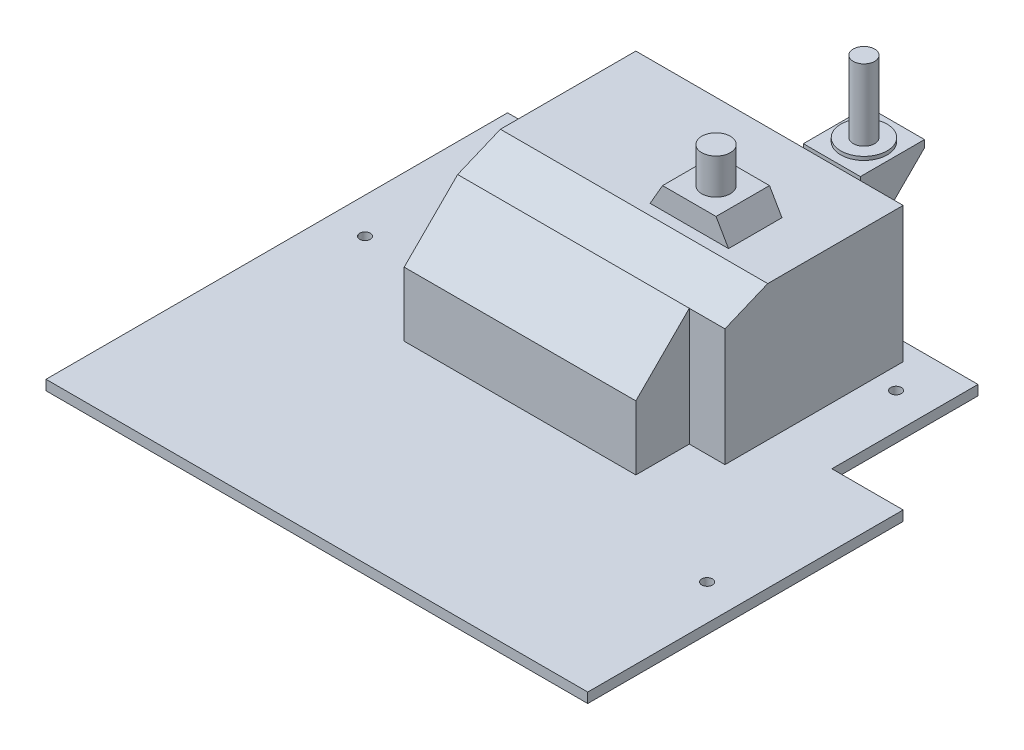
ISO-10303-21;
HEADER;
FILE_DESCRIPTION(('STEP AP214'),'2;1');
FILE_NAME('part.step','',(''),(''),'','','');
FILE_SCHEMA(('AUTOMOTIVE_DESIGN { 1 0 10303 214 1 1 1 1 }'));
ENDSEC;
DATA;
#1=APPLICATION_CONTEXT('core data for automotive mechanical design processes');
#2=APPLICATION_PROTOCOL_DEFINITION('international standard','automotive_design',2000,#1);
#3=PRODUCT_CONTEXT('',#1,'mechanical');
#4=PRODUCT('Part','Part','',(#3));
#5=PRODUCT_RELATED_PRODUCT_CATEGORY('part','',(#4));
#6=PRODUCT_DEFINITION_FORMATION('','',#4);
#7=PRODUCT_DEFINITION_CONTEXT('part definition',#1,'design');
#8=PRODUCT_DEFINITION('design','',#6,#7);
#9=PRODUCT_DEFINITION_SHAPE('','',#8);
#10=(LENGTH_UNIT() NAMED_UNIT(*) SI_UNIT(.MILLI.,.METRE.));
#11=(NAMED_UNIT(*) PLANE_ANGLE_UNIT() SI_UNIT($,.RADIAN.));
#12=(NAMED_UNIT(*) SI_UNIT($,.STERADIAN.) SOLID_ANGLE_UNIT());
#13=UNCERTAINTY_MEASURE_WITH_UNIT(LENGTH_MEASURE(1.E-05),#10,'distance_accuracy_value','');
#14=(GEOMETRIC_REPRESENTATION_CONTEXT(3) GLOBAL_UNCERTAINTY_ASSIGNED_CONTEXT((#13)) GLOBAL_UNIT_ASSIGNED_CONTEXT((#10,
#11,#12)) REPRESENTATION_CONTEXT('',''));
#15=CARTESIAN_POINT('',(0.,0.,0.));
#16=DIRECTION('',(0.,0.,1.));
#17=DIRECTION('',(1.,0.,0.));
#18=AXIS2_PLACEMENT_3D('',#15,#16,#17);
#19=CARTESIAN_POINT('',(0.,40.8,-59.75));
#20=DIRECTION('',(0.,0.,-1.));
#21=DIRECTION('',(-1.,0.,0.));
#22=AXIS2_PLACEMENT_3D('',#19,#20,#21);
#23=PLANE('',#22);
#24=DIRECTION('',(-1.,0.,0.));
#25=VECTOR('',#24,1.);
#26=CARTESIAN_POINT('',(28.,21.8,-59.75));
#27=LINE('',#26,#25);
#28=CARTESIAN_POINT('',(28.,21.8,-59.75));
#29=VERTEX_POINT('',#28);
#30=CARTESIAN_POINT('',(12.,21.8,-59.75));
#31=VERTEX_POINT('',#30);
#32=EDGE_CURVE('E257',#29,#31,#27,.T.);
#33=ORIENTED_EDGE('',*,*,#32,.F.);
#34=DIRECTION('',(0.,-1.,0.));
#35=VECTOR('',#34,1.);
#36=CARTESIAN_POINT('',(28.,41.8,-59.75));
#37=LINE('',#36,#35);
#38=CARTESIAN_POINT('',(28.,40.8,-59.75));
#39=VERTEX_POINT('',#38);
#40=EDGE_CURVE('E242',#39,#29,#37,.T.);
#41=ORIENTED_EDGE('',*,*,#40,.F.);
#42=DIRECTION('',(1.,0.,0.));
#43=VECTOR('',#42,1.);
#44=CARTESIAN_POINT('',(0.,40.8,-59.75));
#45=LINE('',#44,#43);
#46=CARTESIAN_POINT('',(40.,40.8,-59.75));
#47=VERTEX_POINT('',#46);
#48=EDGE_CURVE('E293',#39,#47,#45,.T.);
#49=ORIENTED_EDGE('',*,*,#48,.T.);
#50=DIRECTION('',(0.,-1.,0.));
#51=VECTOR('',#50,1.);
#52=CARTESIAN_POINT('',(40.,40.8,-59.75));
#53=LINE('',#52,#51);
#54=CARTESIAN_POINT('',(40.,2.8,-59.75));
#55=VERTEX_POINT('',#54);
#56=EDGE_CURVE('E320',#47,#55,#53,.T.);
#57=ORIENTED_EDGE('',*,*,#56,.T.);
#58=DIRECTION('',(1.,0.,0.));
#59=VECTOR('',#58,1.);
#60=CARTESIAN_POINT('',(0.,2.8,-59.75));
#61=LINE('',#60,#59);
#62=CARTESIAN_POINT('',(-35.,2.8,-59.75));
#63=VERTEX_POINT('',#62);
#64=EDGE_CURVE('E313',#63,#55,#61,.T.);
#65=ORIENTED_EDGE('',*,*,#64,.F.);
#66=DIRECTION('',(0.,-1.,0.));
#67=VECTOR('',#66,1.);
#68=CARTESIAN_POINT('',(-35.,40.8,-59.75));
#69=LINE('',#68,#67);
#70=CARTESIAN_POINT('',(-35.,40.8,-59.75));
#71=VERTEX_POINT('',#70);
#72=EDGE_CURVE('E317',#71,#63,#69,.T.);
#73=ORIENTED_EDGE('',*,*,#72,.F.);
#74=CARTESIAN_POINT('',(12.,40.8,-59.75));
#75=VERTEX_POINT('',#74);
#76=EDGE_CURVE('E295',#71,#75,#45,.T.);
#77=ORIENTED_EDGE('',*,*,#76,.T.);
#78=DIRECTION('',(0.,1.,0.));
#79=VECTOR('',#78,1.);
#80=CARTESIAN_POINT('',(12.,41.8,-59.75));
#81=LINE('',#80,#79);
#82=EDGE_CURVE('E260',#31,#75,#81,.T.);
#83=ORIENTED_EDGE('',*,*,#82,.F.);
#84=EDGE_LOOP('',(#33,#41,#49,#57,#65,#73,#77,#83));
#85=FACE_BOUND('',#84,.T.);
#86=ADVANCED_FACE('F36',(#85),#23,.T.);
#87=CARTESIAN_POINT('',(0.,2.8,0.));
#88=DIRECTION('',(0.,1.,0.));
#89=DIRECTION('',(0.,0.,1.));
#90=AXIS2_PLACEMENT_3D('',#87,#88,#89);
#91=PLANE('',#90);
#92=CARTESIAN_POINT('',(66.,2.8,21.25));
#93=DIRECTION('',(0.,1.,0.));
#94=DIRECTION('',(0.,0.,1.));
#95=AXIS2_PLACEMENT_3D('',#92,#93,#94);
#96=CIRCLE('',#95,1.5);
#97=CARTESIAN_POINT('',(66.,2.8,22.75));
#98=VERTEX_POINT('',#97);
#99=EDGE_CURVE('E330',#98,#98,#96,.T.);
#100=ORIENTED_EDGE('',*,*,#99,.F.);
#101=EDGE_LOOP('',(#100));
#102=FACE_BOUND('',#101,.T.);
#103=CARTESIAN_POINT('',(-66.,2.8,-14.75));
#104=DIRECTION('',(0.,1.,0.));
#105=DIRECTION('',(0.,0.,1.));
#106=AXIS2_PLACEMENT_3D('',#103,#104,#105);
#107=CIRCLE('',#106,1.5);
#108=CARTESIAN_POINT('',(-66.,2.8,-13.25));
#109=VERTEX_POINT('',#108);
#110=EDGE_CURVE('E333',#109,#109,#107,.T.);
#111=ORIENTED_EDGE('',*,*,#110,.F.);
#112=EDGE_LOOP('',(#111));
#113=FACE_BOUND('',#112,.T.);
#114=CARTESIAN_POINT('',(-46.,2.8,-51.75));
#115=DIRECTION('',(0.,1.,0.));
#116=DIRECTION('',(0.,0.,1.));
#117=AXIS2_PLACEMENT_3D('',#114,#115,#116);
#118=CIRCLE('',#117,1.5);
#119=CARTESIAN_POINT('',(-46.,2.8,-50.25));
#120=VERTEX_POINT('',#119);
#121=EDGE_CURVE('E337',#120,#120,#118,.T.);
#122=ORIENTED_EDGE('',*,*,#121,.F.);
#123=EDGE_LOOP('',(#122));
#124=FACE_BOUND('',#123,.T.);
#125=CARTESIAN_POINT('',(46.,2.8,-51.75));
#126=DIRECTION('',(0.,1.,0.));
#127=DIRECTION('',(0.,0.,1.));
#128=AXIS2_PLACEMENT_3D('',#125,#126,#127);
#129=CIRCLE('',#128,1.5);
#130=CARTESIAN_POINT('',(46.,2.8,-50.25));
#131=VERTEX_POINT('',#130);
#132=EDGE_CURVE('E340',#131,#131,#129,.T.);
#133=ORIENTED_EDGE('',*,*,#132,.F.);
#134=EDGE_LOOP('',(#133));
#135=FACE_BOUND('',#134,.T.);
#136=DIRECTION('',(1.,0.,0.));
#137=VECTOR('',#136,1.);
#138=CARTESIAN_POINT('',(0.,2.8,-23.75));
#139=LINE('',#138,#137);
#140=CARTESIAN_POINT('',(56.,2.8,-23.75));
#141=VERTEX_POINT('',#140);
#142=CARTESIAN_POINT('',(76.,2.8,-23.75));
#143=VERTEX_POINT('',#142);
#144=EDGE_CURVE('E343',#141,#143,#139,.T.);
#145=ORIENTED_EDGE('',*,*,#144,.F.);
#146=DIRECTION('',(0.,0.,1.));
#147=VECTOR('',#146,1.);
#148=CARTESIAN_POINT('',(56.,2.8,0.));
#149=LINE('',#148,#147);
#150=CARTESIAN_POINT('',(56.,2.8,-64.75));
#151=VERTEX_POINT('',#150);
#152=EDGE_CURVE('E346',#151,#141,#149,.T.);
#153=ORIENTED_EDGE('',*,*,#152,.F.);
#154=DIRECTION('',(1.,0.,0.));
#155=VECTOR('',#154,1.);
#156=CARTESIAN_POINT('',(0.,2.8,-64.75));
#157=LINE('',#156,#155);
#158=CARTESIAN_POINT('',(-76.,2.8,-64.75));
#159=VERTEX_POINT('',#158);
#160=EDGE_CURVE('E349',#159,#151,#157,.T.);
#161=ORIENTED_EDGE('',*,*,#160,.F.);
#162=DIRECTION('',(0.,0.,-1.));
#163=VECTOR('',#162,1.);
#164=CARTESIAN_POINT('',(-76.,2.8,0.));
#165=LINE('',#164,#163);
#166=CARTESIAN_POINT('',(-76.,2.8,64.75));
#167=VERTEX_POINT('',#166);
#168=EDGE_CURVE('E352',#167,#159,#165,.T.);
#169=ORIENTED_EDGE('',*,*,#168,.F.);
#170=DIRECTION('',(1.,0.,0.));
#171=VECTOR('',#170,1.);
#172=CARTESIAN_POINT('',(0.,2.8,64.75));
#173=LINE('',#172,#171);
#174=CARTESIAN_POINT('',(76.,2.8,64.75));
#175=VERTEX_POINT('',#174);
#176=EDGE_CURVE('E355',#167,#175,#173,.T.);
#177=ORIENTED_EDGE('',*,*,#176,.T.);
#178=DIRECTION('',(0.,0.,-1.));
#179=VECTOR('',#178,1.);
#180=CARTESIAN_POINT('',(76.,2.8,0.));
#181=LINE('',#180,#179);
#182=EDGE_CURVE('E358',#175,#143,#181,.T.);
#183=ORIENTED_EDGE('',*,*,#182,.T.);
#184=EDGE_LOOP('',(#145,#153,#161,#169,#177,#183));
#185=FACE_BOUND('',#184,.T.);
#186=DIRECTION('',(0.,0.,-1.));
#187=VECTOR('',#186,1.);
#188=CARTESIAN_POINT('',(30.,2.8,0.));
#189=LINE('',#188,#187);
#190=CARTESIAN_POINT('',(30.,2.8,5.25));
#191=VERTEX_POINT('',#190);
#192=CARTESIAN_POINT('',(30.,2.8,-9.75));
#193=VERTEX_POINT('',#192);
#194=EDGE_CURVE('E304',#191,#193,#189,.T.);
#195=ORIENTED_EDGE('',*,*,#194,.F.);
#196=DIRECTION('',(1.,0.,0.));
#197=VECTOR('',#196,1.);
#198=CARTESIAN_POINT('',(0.,2.8,5.25));
#199=LINE('',#198,#197);
#200=CARTESIAN_POINT('',(-35.,2.8,5.25));
#201=VERTEX_POINT('',#200);
#202=EDGE_CURVE('E286',#201,#191,#199,.T.);
#203=ORIENTED_EDGE('',*,*,#202,.F.);
#204=DIRECTION('',(0.,0.,-1.));
#205=VECTOR('',#204,1.);
#206=CARTESIAN_POINT('',(-35.,2.8,0.));
#207=LINE('',#206,#205);
#208=EDGE_CURVE('E294',#201,#63,#207,.T.);
#209=ORIENTED_EDGE('',*,*,#208,.T.);
#210=ORIENTED_EDGE('',*,*,#64,.T.);
#211=DIRECTION('',(0.,0.,-1.));
#212=VECTOR('',#211,1.);
#213=CARTESIAN_POINT('',(40.,2.8,0.));
#214=LINE('',#213,#212);
#215=CARTESIAN_POINT('',(40.,2.8,-9.75));
#216=VERTEX_POINT('',#215);
#217=EDGE_CURVE('E310',#216,#55,#214,.T.);
#218=ORIENTED_EDGE('',*,*,#217,.F.);
#219=DIRECTION('',(-1.,0.,0.));
#220=VECTOR('',#219,1.);
#221=CARTESIAN_POINT('',(0.,2.8,-9.75));
#222=LINE('',#221,#220);
#223=EDGE_CURVE('E307',#216,#193,#222,.T.);
#224=ORIENTED_EDGE('',*,*,#223,.T.);
#225=EDGE_LOOP('',(#195,#203,#209,#210,#218,#224));
#226=FACE_BOUND('',#225,.T.);
#227=ADVANCED_FACE('F428',(#102,#113,#124,#135,#185,#226),#91,.T.);
#228=CARTESIAN_POINT('',(0.,2.8,-23.75));
#229=DIRECTION('',(0.,0.,-1.));
#230=DIRECTION('',(-1.,0.,0.));
#231=AXIS2_PLACEMENT_3D('',#228,#229,#230);
#232=PLANE('',#231);
#233=DIRECTION('',(1.,0.,0.));
#234=VECTOR('',#233,1.);
#235=CARTESIAN_POINT('',(0.,0.,-23.75));
#236=LINE('',#235,#234);
#237=CARTESIAN_POINT('',(56.,0.,-23.75));
#238=VERTEX_POINT('',#237);
#239=CARTESIAN_POINT('',(76.,0.,-23.75));
#240=VERTEX_POINT('',#239);
#241=EDGE_CURVE('E372',#238,#240,#236,.T.);
#242=ORIENTED_EDGE('',*,*,#241,.F.);
#243=DIRECTION('',(0.,-1.,0.));
#244=VECTOR('',#243,1.);
#245=CARTESIAN_POINT('',(56.,2.8,-23.75));
#246=LINE('',#245,#244);
#247=EDGE_CURVE('E399',#141,#238,#246,.T.);
#248=ORIENTED_EDGE('',*,*,#247,.F.);
#249=ORIENTED_EDGE('',*,*,#144,.T.);
#250=DIRECTION('',(0.,-1.,0.));
#251=VECTOR('',#250,1.);
#252=CARTESIAN_POINT('',(76.,2.8,-23.75));
#253=LINE('',#252,#251);
#254=EDGE_CURVE('E360',#143,#240,#253,.T.);
#255=ORIENTED_EDGE('',*,*,#254,.T.);
#256=EDGE_LOOP('',(#242,#248,#249,#255));
#257=FACE_BOUND('',#256,.T.);
#258=ADVANCED_FACE('F434',(#257),#232,.T.);
#259=CARTESIAN_POINT('',(56.,2.8,0.));
#260=DIRECTION('',(1.,0.,0.));
#261=DIRECTION('',(0.,0.,-1.));
#262=AXIS2_PLACEMENT_3D('',#259,#260,#261);
#263=PLANE('',#262);
#264=DIRECTION('',(0.,0.,1.));
#265=VECTOR('',#264,1.);
#266=CARTESIAN_POINT('',(56.,0.,0.));
#267=LINE('',#266,#265);
#268=CARTESIAN_POINT('',(56.,0.,-64.75));
#269=VERTEX_POINT('',#268);
#270=EDGE_CURVE('E375',#269,#238,#267,.T.);
#271=ORIENTED_EDGE('',*,*,#270,.F.);
#272=DIRECTION('',(0.,-1.,0.));
#273=VECTOR('',#272,1.);
#274=CARTESIAN_POINT('',(56.,2.8,-64.75));
#275=LINE('',#274,#273);
#276=EDGE_CURVE('E397',#151,#269,#275,.T.);
#277=ORIENTED_EDGE('',*,*,#276,.F.);
#278=ORIENTED_EDGE('',*,*,#152,.T.);
#279=ORIENTED_EDGE('',*,*,#247,.T.);
#280=EDGE_LOOP('',(#271,#277,#278,#279));
#281=FACE_BOUND('',#280,.T.);
#282=ADVANCED_FACE('F478',(#281),#263,.T.);
#283=CARTESIAN_POINT('',(0.,2.8,-64.75));
#284=DIRECTION('',(0.,0.,-1.));
#285=DIRECTION('',(-1.,0.,0.));
#286=AXIS2_PLACEMENT_3D('',#283,#284,#285);
#287=PLANE('',#286);
#288=DIRECTION('',(1.,0.,0.));
#289=VECTOR('',#288,1.);
#290=CARTESIAN_POINT('',(0.,0.,-64.75));
#291=LINE('',#290,#289);
#292=CARTESIAN_POINT('',(-76.,0.,-64.75));
#293=VERTEX_POINT('',#292);
#294=EDGE_CURVE('E378',#293,#269,#291,.T.);
#295=ORIENTED_EDGE('',*,*,#294,.F.);
#296=DIRECTION('',(0.,-1.,0.));
#297=VECTOR('',#296,1.);
#298=CARTESIAN_POINT('',(-76.,2.8,-64.75));
#299=LINE('',#298,#297);
#300=EDGE_CURVE('E395',#159,#293,#299,.T.);
#301=ORIENTED_EDGE('',*,*,#300,.F.);
#302=ORIENTED_EDGE('',*,*,#160,.T.);
#303=ORIENTED_EDGE('',*,*,#276,.T.);
#304=EDGE_LOOP('',(#295,#301,#302,#303));
#305=FACE_BOUND('',#304,.T.);
#306=ADVANCED_FACE('F474',(#305),#287,.T.);
#307=CARTESIAN_POINT('',(-76.,2.8,0.));
#308=DIRECTION('',(-1.,0.,0.));
#309=DIRECTION('',(0.,0.,1.));
#310=AXIS2_PLACEMENT_3D('',#307,#308,#309);
#311=PLANE('',#310);
#312=DIRECTION('',(0.,0.,-1.));
#313=VECTOR('',#312,1.);
#314=CARTESIAN_POINT('',(-76.,0.,0.));
#315=LINE('',#314,#313);
#316=CARTESIAN_POINT('',(-76.,0.,64.75));
#317=VERTEX_POINT('',#316);
#318=EDGE_CURVE('E381',#317,#293,#315,.T.);
#319=ORIENTED_EDGE('',*,*,#318,.F.);
#320=DIRECTION('',(0.,-1.,0.));
#321=VECTOR('',#320,1.);
#322=CARTESIAN_POINT('',(-76.,2.8,64.75));
#323=LINE('',#322,#321);
#324=EDGE_CURVE('E393',#167,#317,#323,.T.);
#325=ORIENTED_EDGE('',*,*,#324,.F.);
#326=ORIENTED_EDGE('',*,*,#168,.T.);
#327=ORIENTED_EDGE('',*,*,#300,.T.);
#328=EDGE_LOOP('',(#319,#325,#326,#327));
#329=FACE_BOUND('',#328,.T.);
#330=ADVANCED_FACE('F470',(#329),#311,.T.);
#331=CARTESIAN_POINT('',(0.,2.8,64.75));
#332=DIRECTION('',(0.,0.,-1.));
#333=DIRECTION('',(-1.,0.,0.));
#334=AXIS2_PLACEMENT_3D('',#331,#332,#333);
#335=PLANE('',#334);
#336=DIRECTION('',(1.,0.,0.));
#337=VECTOR('',#336,1.);
#338=CARTESIAN_POINT('',(0.,0.,64.75));
#339=LINE('',#338,#337);
#340=CARTESIAN_POINT('',(76.,0.,64.75));
#341=VERTEX_POINT('',#340);
#342=EDGE_CURVE('E384',#317,#341,#339,.T.);
#343=ORIENTED_EDGE('',*,*,#342,.T.);
#344=DIRECTION('',(0.,-1.,0.));
#345=VECTOR('',#344,1.);
#346=CARTESIAN_POINT('',(76.,2.8,64.75));
#347=LINE('',#346,#345);
#348=EDGE_CURVE('E390',#175,#341,#347,.T.);
#349=ORIENTED_EDGE('',*,*,#348,.F.);
#350=ORIENTED_EDGE('',*,*,#176,.F.);
#351=ORIENTED_EDGE('',*,*,#324,.T.);
#352=EDGE_LOOP('',(#343,#349,#350,#351));
#353=FACE_BOUND('',#352,.T.);
#354=ADVANCED_FACE('F466',(#353),#335,.F.);
#355=CARTESIAN_POINT('',(46.,2.8,-51.75));
#356=DIRECTION('',(0.,-1.,0.));
#357=DIRECTION('',(0.,0.,-1.));
#358=AXIS2_PLACEMENT_3D('',#355,#356,#357);
#359=CYLINDRICAL_SURFACE('',#358,1.5);
#360=ORIENTED_EDGE('',*,*,#132,.T.);
#361=EDGE_LOOP('',(#360));
#362=FACE_BOUND('',#361,.T.);
#363=CARTESIAN_POINT('',(46.,0.,-51.75));
#364=DIRECTION('',(0.,1.,0.));
#365=DIRECTION('',(0.,0.,1.));
#366=AXIS2_PLACEMENT_3D('',#363,#364,#365);
#367=CIRCLE('',#366,1.5);
#368=CARTESIAN_POINT('',(46.,0.,-50.25));
#369=VERTEX_POINT('',#368);
#370=EDGE_CURVE('E369',#369,#369,#367,.T.);
#371=ORIENTED_EDGE('',*,*,#370,.F.);
#372=EDGE_LOOP('',(#371));
#373=FACE_BOUND('',#372,.T.);
#374=ADVANCED_FACE('F469',(#362,#373),#359,.F.);
#375=CARTESIAN_POINT('',(-46.,2.8,-51.75));
#376=DIRECTION('',(0.,-1.,0.));
#377=DIRECTION('',(0.,0.,-1.));
#378=AXIS2_PLACEMENT_3D('',#375,#376,#377);
#379=CYLINDRICAL_SURFACE('',#378,1.5);
#380=ORIENTED_EDGE('',*,*,#121,.T.);
#381=EDGE_LOOP('',(#380));
#382=FACE_BOUND('',#381,.T.);
#383=CARTESIAN_POINT('',(-46.,0.,-51.75));
#384=DIRECTION('',(0.,1.,0.));
#385=DIRECTION('',(0.,0.,1.));
#386=AXIS2_PLACEMENT_3D('',#383,#384,#385);
#387=CIRCLE('',#386,1.5);
#388=CARTESIAN_POINT('',(-46.,0.,-50.25));
#389=VERTEX_POINT('',#388);
#390=EDGE_CURVE('E366',#389,#389,#387,.T.);
#391=ORIENTED_EDGE('',*,*,#390,.F.);
#392=EDGE_LOOP('',(#391));
#393=FACE_BOUND('',#392,.T.);
#394=ADVANCED_FACE('F488',(#382,#393),#379,.F.);
#395=CARTESIAN_POINT('',(-66.,2.8,-14.75));
#396=DIRECTION('',(0.,-1.,0.));
#397=DIRECTION('',(0.,0.,-1.));
#398=AXIS2_PLACEMENT_3D('',#395,#396,#397);
#399=CYLINDRICAL_SURFACE('',#398,1.5);
#400=ORIENTED_EDGE('',*,*,#110,.T.);
#401=EDGE_LOOP('',(#400));
#402=FACE_BOUND('',#401,.T.);
#403=CARTESIAN_POINT('',(-66.,0.,-14.75));
#404=DIRECTION('',(0.,1.,0.));
#405=DIRECTION('',(0.,0.,1.));
#406=AXIS2_PLACEMENT_3D('',#403,#404,#405);
#407=CIRCLE('',#406,1.5);
#408=CARTESIAN_POINT('',(-66.,0.,-13.25));
#409=VERTEX_POINT('',#408);
#410=EDGE_CURVE('E363',#409,#409,#407,.T.);
#411=ORIENTED_EDGE('',*,*,#410,.F.);
#412=EDGE_LOOP('',(#411));
#413=FACE_BOUND('',#412,.T.);
#414=ADVANCED_FACE('F492',(#402,#413),#399,.F.);
#415=CARTESIAN_POINT('',(66.,2.8,21.25));
#416=DIRECTION('',(0.,-1.,0.));
#417=DIRECTION('',(0.,0.,-1.));
#418=AXIS2_PLACEMENT_3D('',#415,#416,#417);
#419=CYLINDRICAL_SURFACE('',#418,1.5);
#420=ORIENTED_EDGE('',*,*,#99,.T.);
#421=EDGE_LOOP('',(#420));
#422=FACE_BOUND('',#421,.T.);
#423=CARTESIAN_POINT('',(66.,0.,21.25));
#424=DIRECTION('',(0.,1.,0.));
#425=DIRECTION('',(0.,0.,1.));
#426=AXIS2_PLACEMENT_3D('',#423,#424,#425);
#427=CIRCLE('',#426,1.5);
#428=CARTESIAN_POINT('',(66.,0.,22.75));
#429=VERTEX_POINT('',#428);
#430=EDGE_CURVE('E329',#429,#429,#427,.T.);
#431=ORIENTED_EDGE('',*,*,#430,.F.);
#432=EDGE_LOOP('',(#431));
#433=FACE_BOUND('',#432,.T.);
#434=ADVANCED_FACE('F464',(#422,#433),#419,.F.);
#435=CARTESIAN_POINT('',(76.,2.8,0.));
#436=DIRECTION('',(-1.,0.,0.));
#437=DIRECTION('',(0.,0.,1.));
#438=AXIS2_PLACEMENT_3D('',#435,#436,#437);
#439=PLANE('',#438);
#440=DIRECTION('',(0.,0.,-1.));
#441=VECTOR('',#440,1.);
#442=CARTESIAN_POINT('',(76.,0.,0.));
#443=LINE('',#442,#441);
#444=EDGE_CURVE('E334',#341,#240,#443,.T.);
#445=ORIENTED_EDGE('',*,*,#444,.T.);
#446=ORIENTED_EDGE('',*,*,#254,.F.);
#447=ORIENTED_EDGE('',*,*,#182,.F.);
#448=ORIENTED_EDGE('',*,*,#348,.T.);
#449=EDGE_LOOP('',(#445,#446,#447,#448));
#450=FACE_BOUND('',#449,.T.);
#451=ADVANCED_FACE('F460',(#450),#439,.F.);
#452=CARTESIAN_POINT('',(0.,0.,0.));
#453=DIRECTION('',(0.,1.,0.));
#454=DIRECTION('',(0.,0.,1.));
#455=AXIS2_PLACEMENT_3D('',#452,#453,#454);
#456=PLANE('',#455);
#457=ORIENTED_EDGE('',*,*,#430,.T.);
#458=EDGE_LOOP('',(#457));
#459=FACE_BOUND('',#458,.T.);
#460=ORIENTED_EDGE('',*,*,#410,.T.);
#461=EDGE_LOOP('',(#460));
#462=FACE_BOUND('',#461,.T.);
#463=ORIENTED_EDGE('',*,*,#390,.T.);
#464=EDGE_LOOP('',(#463));
#465=FACE_BOUND('',#464,.T.);
#466=ORIENTED_EDGE('',*,*,#370,.T.);
#467=EDGE_LOOP('',(#466));
#468=FACE_BOUND('',#467,.T.);
#469=ORIENTED_EDGE('',*,*,#241,.T.);
#470=ORIENTED_EDGE('',*,*,#444,.F.);
#471=ORIENTED_EDGE('',*,*,#342,.F.);
#472=ORIENTED_EDGE('',*,*,#318,.T.);
#473=ORIENTED_EDGE('',*,*,#294,.T.);
#474=ORIENTED_EDGE('',*,*,#270,.T.);
#475=EDGE_LOOP('',(#469,#470,#471,#472,#473,#474));
#476=FACE_BOUND('',#475,.T.);
#477=ADVANCED_FACE('F455',(#459,#462,#465,#468,#476),#456,.F.);
#478=CARTESIAN_POINT('',(0.,40.8,5.25));
#479=DIRECTION('',(0.,0.,-1.));
#480=DIRECTION('',(-1.,0.,0.));
#481=AXIS2_PLACEMENT_3D('',#478,#479,#480);
#482=PLANE('',#481);
#483=DIRECTION('',(0.,-1.,0.));
#484=VECTOR('',#483,1.);
#485=CARTESIAN_POINT('',(30.,40.8,5.25));
#486=LINE('',#485,#484);
#487=CARTESIAN_POINT('',(30.,20.7999999999998,5.25));
#488=VERTEX_POINT('',#487);
#489=EDGE_CURVE('E327',#488,#191,#486,.T.);
#490=ORIENTED_EDGE('',*,*,#489,.F.);
#491=DIRECTION('',(-1.,0.,0.));
#492=VECTOR('',#491,1.);
#493=CARTESIAN_POINT('',(76.001,20.7999999999998,5.25));
#494=LINE('',#493,#492);
#495=CARTESIAN_POINT('',(-35.,20.7999999999998,5.25));
#496=VERTEX_POINT('',#495);
#497=EDGE_CURVE('E283',#488,#496,#494,.T.);
#498=ORIENTED_EDGE('',*,*,#497,.T.);
#499=DIRECTION('',(0.,-1.,0.));
#500=VECTOR('',#499,1.);
#501=CARTESIAN_POINT('',(-35.,40.8,5.25));
#502=LINE('',#501,#500);
#503=EDGE_CURVE('E301',#496,#201,#502,.T.);
#504=ORIENTED_EDGE('',*,*,#503,.T.);
#505=ORIENTED_EDGE('',*,*,#202,.T.);
#506=EDGE_LOOP('',(#490,#498,#504,#505));
#507=FACE_BOUND('',#506,.T.);
#508=ADVANCED_FACE('F452',(#507),#482,.F.);
#509=CARTESIAN_POINT('',(30.,40.8,0.));
#510=DIRECTION('',(-1.,0.,0.));
#511=DIRECTION('',(0.,0.,1.));
#512=AXIS2_PLACEMENT_3D('',#509,#510,#511);
#513=PLANE('',#512);
#514=DIRECTION('',(0.,-1.,0.));
#515=VECTOR('',#514,1.);
#516=CARTESIAN_POINT('',(30.,40.8,-9.75));
#517=LINE('',#516,#515);
#518=CARTESIAN_POINT('',(30.,35.8,-9.75));
#519=VERTEX_POINT('',#518);
#520=EDGE_CURVE('E325',#519,#193,#517,.T.);
#521=ORIENTED_EDGE('',*,*,#520,.F.);
#522=DIRECTION('',(0.,0.707106781186551,-0.707106781186544));
#523=VECTOR('',#522,1.);
#524=CARTESIAN_POINT('',(30.,20.7999999999998,5.25));
#525=LINE('',#524,#523);
#526=EDGE_CURVE('E274',#488,#519,#525,.T.);
#527=ORIENTED_EDGE('',*,*,#526,.F.);
#528=ORIENTED_EDGE('',*,*,#489,.T.);
#529=ORIENTED_EDGE('',*,*,#194,.T.);
#530=EDGE_LOOP('',(#521,#527,#528,#529));
#531=FACE_BOUND('',#530,.T.);
#532=ADVANCED_FACE('F448',(#531),#513,.F.);
#533=CARTESIAN_POINT('',(0.,40.8,-9.75));
#534=DIRECTION('',(0.,0.,1.));
#535=DIRECTION('',(1.,0.,0.));
#536=AXIS2_PLACEMENT_3D('',#533,#534,#535);
#537=PLANE('',#536);
#538=DIRECTION('',(-1.,0.,0.));
#539=VECTOR('',#538,1.);
#540=CARTESIAN_POINT('',(76.001,35.8,-9.75));
#541=LINE('',#540,#539);
#542=CARTESIAN_POINT('',(40.,35.8,-9.75));
#543=VERTEX_POINT('',#542);
#544=EDGE_CURVE('E271',#543,#519,#541,.T.);
#545=ORIENTED_EDGE('',*,*,#544,.T.);
#546=ORIENTED_EDGE('',*,*,#520,.T.);
#547=ORIENTED_EDGE('',*,*,#223,.F.);
#548=DIRECTION('',(0.,-1.,0.));
#549=VECTOR('',#548,1.);
#550=CARTESIAN_POINT('',(40.,40.8,-9.75));
#551=LINE('',#550,#549);
#552=EDGE_CURVE('E323',#543,#216,#551,.T.);
#553=ORIENTED_EDGE('',*,*,#552,.F.);
#554=EDGE_LOOP('',(#545,#546,#547,#553));
#555=FACE_BOUND('',#554,.T.);
#556=ADVANCED_FACE('F444',(#555),#537,.T.);
#557=CARTESIAN_POINT('',(40.,40.8,0.));
#558=DIRECTION('',(-1.,0.,0.));
#559=DIRECTION('',(0.,0.,1.));
#560=AXIS2_PLACEMENT_3D('',#557,#558,#559);
#561=PLANE('',#560);
#562=DIRECTION('',(0.,0.,-1.));
#563=VECTOR('',#562,1.);
#564=CARTESIAN_POINT('',(40.,40.8,0.));
#565=LINE('',#564,#563);
#566=CARTESIAN_POINT('',(40.,40.8,-21.75));
#567=VERTEX_POINT('',#566);
#568=EDGE_CURVE('E290',#567,#47,#565,.T.);
#569=ORIENTED_EDGE('',*,*,#568,.F.);
#570=DIRECTION('',(0.,0.384615384615384,-0.923076923076923));
#571=VECTOR('',#570,1.);
#572=CARTESIAN_POINT('',(40.,35.8,-9.75000000000001));
#573=LINE('',#572,#571);
#574=EDGE_CURVE('E269',#543,#567,#573,.T.);
#575=ORIENTED_EDGE('',*,*,#574,.F.);
#576=ORIENTED_EDGE('',*,*,#552,.T.);
#577=ORIENTED_EDGE('',*,*,#217,.T.);
#578=ORIENTED_EDGE('',*,*,#56,.F.);
#579=EDGE_LOOP('',(#569,#575,#576,#577,#578));
#580=FACE_BOUND('',#579,.T.);
#581=ADVANCED_FACE('F441',(#580),#561,.F.);
#582=CARTESIAN_POINT('',(-35.,40.8,0.));
#583=DIRECTION('',(-1.,0.,0.));
#584=DIRECTION('',(0.,0.,1.));
#585=AXIS2_PLACEMENT_3D('',#582,#583,#584);
#586=PLANE('',#585);
#587=DIRECTION('',(0.,-0.707106781186551,0.707106781186544));
#588=VECTOR('',#587,1.);
#589=CARTESIAN_POINT('',(-35.,20.7999999999998,5.25));
#590=LINE('',#589,#588);
#591=CARTESIAN_POINT('',(-35.,35.8,-9.75));
#592=VERTEX_POINT('',#591);
#593=EDGE_CURVE('E280',#592,#496,#590,.T.);
#594=ORIENTED_EDGE('',*,*,#593,.F.);
#595=DIRECTION('',(0.,-0.384615384615384,0.923076923076923));
#596=VECTOR('',#595,1.);
#597=CARTESIAN_POINT('',(-35.,35.8,-9.75));
#598=LINE('',#597,#596);
#599=CARTESIAN_POINT('',(-35.,40.8,-21.75));
#600=VERTEX_POINT('',#599);
#601=EDGE_CURVE('E277',#600,#592,#598,.T.);
#602=ORIENTED_EDGE('',*,*,#601,.F.);
#603=DIRECTION('',(0.,0.,-1.));
#604=VECTOR('',#603,1.);
#605=CARTESIAN_POINT('',(-35.,40.8,0.));
#606=LINE('',#605,#604);
#607=EDGE_CURVE('E298',#600,#71,#606,.T.);
#608=ORIENTED_EDGE('',*,*,#607,.T.);
#609=ORIENTED_EDGE('',*,*,#72,.T.);
#610=ORIENTED_EDGE('',*,*,#208,.F.);
#611=ORIENTED_EDGE('',*,*,#503,.F.);
#612=EDGE_LOOP('',(#594,#602,#608,#609,#610,#611));
#613=FACE_BOUND('',#612,.T.);
#614=ADVANCED_FACE('F439',(#613),#586,.T.);
#615=CARTESIAN_POINT('',(0.,40.8,0.));
#616=DIRECTION('',(0.,1.,0.));
#617=DIRECTION('',(0.,0.,1.));
#618=AXIS2_PLACEMENT_3D('',#615,#616,#617);
#619=PLANE('',#618);
#620=DIRECTION('',(1.,0.,0.));
#621=VECTOR('',#620,1.);
#622=CARTESIAN_POINT('',(26.,40.8,-39.75));
#623=LINE('',#622,#621);
#624=CARTESIAN_POINT('',(3.99999999999998,40.8,-39.75));
#625=VERTEX_POINT('',#624);
#626=CARTESIAN_POINT('',(26.,40.8,-39.75));
#627=VERTEX_POINT('',#626);
#628=EDGE_CURVE('E203',#625,#627,#623,.T.);
#629=ORIENTED_EDGE('',*,*,#628,.T.);
#630=DIRECTION('',(0.,0.,1.));
#631=VECTOR('',#630,1.);
#632=CARTESIAN_POINT('',(26.,40.8,-39.75));
#633=LINE('',#632,#631);
#634=CARTESIAN_POINT('',(26.,40.8,-24.75));
#635=VERTEX_POINT('',#634);
#636=EDGE_CURVE('E216',#627,#635,#633,.T.);
#637=ORIENTED_EDGE('',*,*,#636,.T.);
#638=DIRECTION('',(1.,0.,0.));
#639=VECTOR('',#638,1.);
#640=CARTESIAN_POINT('',(26.,40.8,-24.75));
#641=LINE('',#640,#639);
#642=CARTESIAN_POINT('',(3.99999999999998,40.8,-24.75));
#643=VERTEX_POINT('',#642);
#644=EDGE_CURVE('E217',#643,#635,#641,.T.);
#645=ORIENTED_EDGE('',*,*,#644,.F.);
#646=DIRECTION('',(0.,0.,1.));
#647=VECTOR('',#646,1.);
#648=CARTESIAN_POINT('',(3.99999999999998,40.8,-39.75));
#649=LINE('',#648,#647);
#650=EDGE_CURVE('E231',#625,#643,#649,.T.);
#651=ORIENTED_EDGE('',*,*,#650,.F.);
#652=EDGE_LOOP('',(#629,#637,#645,#651));
#653=FACE_BOUND('',#652,.T.);
#654=DIRECTION('',(-1.,0.,0.));
#655=VECTOR('',#654,1.);
#656=CARTESIAN_POINT('',(76.001,40.8,-21.75));
#657=LINE('',#656,#655);
#658=EDGE_CURVE('E282',#567,#600,#657,.T.);
#659=ORIENTED_EDGE('',*,*,#658,.F.);
#660=ORIENTED_EDGE('',*,*,#568,.T.);
#661=ORIENTED_EDGE('',*,*,#48,.F.);
#662=EDGE_CURVE('E299',#75,#39,#45,.T.);
#663=ORIENTED_EDGE('',*,*,#662,.F.);
#664=ORIENTED_EDGE('',*,*,#76,.F.);
#665=ORIENTED_EDGE('',*,*,#607,.F.);
#666=EDGE_LOOP('',(#659,#660,#661,#663,#664,#665));
#667=FACE_BOUND('',#666,.T.);
#668=ADVANCED_FACE('F550',(#653,#667),#619,.T.);
#669=CARTESIAN_POINT('',(76.001,20.7999999999998,5.25));
#670=DIRECTION('',(0.,-0.707106781186544,-0.707106781186551));
#671=DIRECTION('',(0.,0.707106781186551,-0.707106781186544));
#672=AXIS2_PLACEMENT_3D('',#669,#670,#671);
#673=PLANE('',#672);
#674=ORIENTED_EDGE('',*,*,#526,.T.);
#675=DIRECTION('',(-1.,0.,0.));
#676=VECTOR('',#675,1.);
#677=CARTESIAN_POINT('',(76.001,35.8,-9.75));
#678=LINE('',#677,#676);
#679=EDGE_CURVE('E287',#519,#592,#678,.T.);
#680=ORIENTED_EDGE('',*,*,#679,.T.);
#681=ORIENTED_EDGE('',*,*,#593,.T.);
#682=ORIENTED_EDGE('',*,*,#497,.F.);
#683=EDGE_LOOP('',(#674,#680,#681,#682));
#684=FACE_BOUND('',#683,.T.);
#685=ADVANCED_FACE('F543',(#684),#673,.F.);
#686=CARTESIAN_POINT('',(76.001,35.8,-9.75));
#687=DIRECTION('',(0.,-0.923076923076923,-0.384615384615384));
#688=DIRECTION('',(0.,0.384615384615384,-0.923076923076923));
#689=AXIS2_PLACEMENT_3D('',#686,#687,#688);
#690=PLANE('',#689);
#691=ORIENTED_EDGE('',*,*,#574,.T.);
#692=ORIENTED_EDGE('',*,*,#658,.T.);
#693=ORIENTED_EDGE('',*,*,#601,.T.);
#694=ORIENTED_EDGE('',*,*,#679,.F.);
#695=ORIENTED_EDGE('',*,*,#544,.F.);
#696=EDGE_LOOP('',(#691,#692,#693,#694,#695));
#697=FACE_BOUND('',#696,.T.);
#698=ADVANCED_FACE('F545',(#697),#690,.F.);
#699=CARTESIAN_POINT('',(28.,41.8,-77.75));
#700=DIRECTION('',(-1.,0.,0.));
#701=DIRECTION('',(0.,-1.,0.));
#702=AXIS2_PLACEMENT_3D('',#699,#700,#701);
#703=PLANE('',#702);
#704=ORIENTED_EDGE('',*,*,#40,.T.);
#705=DIRECTION('',(0.,0.707106781186546,-0.707106781186549));
#706=VECTOR('',#705,1.);
#707=CARTESIAN_POINT('',(28.,39.8,-77.75));
#708=LINE('',#707,#706);
#709=CARTESIAN_POINT('',(28.,39.8,-77.75));
#710=VERTEX_POINT('',#709);
#711=EDGE_CURVE('E41',#29,#710,#708,.T.);
#712=ORIENTED_EDGE('',*,*,#711,.T.);
#713=DIRECTION('',(0.,-1.,0.));
#714=VECTOR('',#713,1.);
#715=CARTESIAN_POINT('',(28.,41.8,-77.75));
#716=LINE('',#715,#714);
#717=CARTESIAN_POINT('',(28.,41.8,-77.75));
#718=VERTEX_POINT('',#717);
#719=EDGE_CURVE('E245',#718,#710,#716,.T.);
#720=ORIENTED_EDGE('',*,*,#719,.F.);
#721=DIRECTION('',(0.,0.,1.));
#722=VECTOR('',#721,1.);
#723=CARTESIAN_POINT('',(28.,41.8,-77.75));
#724=LINE('',#723,#722);
#725=CARTESIAN_POINT('',(28.,41.8,-59.75));
#726=VERTEX_POINT('',#725);
#727=EDGE_CURVE('E253',#718,#726,#724,.T.);
#728=ORIENTED_EDGE('',*,*,#727,.T.);
#729=EDGE_CURVE('E254',#726,#39,#37,.T.);
#730=ORIENTED_EDGE('',*,*,#729,.T.);
#731=EDGE_LOOP('',(#704,#712,#720,#728,#730));
#732=FACE_BOUND('',#731,.T.);
#733=ADVANCED_FACE('F409',(#732),#703,.F.);
#734=CARTESIAN_POINT('',(12.,41.8,-77.75));
#735=DIRECTION('',(1.,0.,0.));
#736=DIRECTION('',(0.,1.,0.));
#737=AXIS2_PLACEMENT_3D('',#734,#735,#736);
#738=PLANE('',#737);
#739=DIRECTION('',(0.,1.,0.));
#740=VECTOR('',#739,1.);
#741=CARTESIAN_POINT('',(12.,41.8,-77.75));
#742=LINE('',#741,#740);
#743=CARTESIAN_POINT('',(12.,39.8,-77.75));
#744=VERTEX_POINT('',#743);
#745=CARTESIAN_POINT('',(12.,41.8,-77.75));
#746=VERTEX_POINT('',#745);
#747=EDGE_CURVE('E248',#744,#746,#742,.T.);
#748=ORIENTED_EDGE('',*,*,#747,.F.);
#749=DIRECTION('',(0.,-0.707106781186546,0.707106781186549));
#750=VECTOR('',#749,1.);
#751=CARTESIAN_POINT('',(12.,39.8,-77.75));
#752=LINE('',#751,#750);
#753=EDGE_CURVE('E62',#744,#31,#752,.T.);
#754=ORIENTED_EDGE('',*,*,#753,.T.);
#755=ORIENTED_EDGE('',*,*,#82,.T.);
#756=CARTESIAN_POINT('',(12.,41.8,-59.75));
#757=VERTEX_POINT('',#756);
#758=EDGE_CURVE('E259',#75,#757,#81,.T.);
#759=ORIENTED_EDGE('',*,*,#758,.T.);
#760=DIRECTION('',(0.,0.,1.));
#761=VECTOR('',#760,1.);
#762=CARTESIAN_POINT('',(12.,41.8,-77.75));
#763=LINE('',#762,#761);
#764=EDGE_CURVE('E266',#746,#757,#763,.T.);
#765=ORIENTED_EDGE('',*,*,#764,.F.);
#766=EDGE_LOOP('',(#748,#754,#755,#759,#765));
#767=FACE_BOUND('',#766,.T.);
#768=ADVANCED_FACE('F556',(#767),#738,.F.);
#769=CARTESIAN_POINT('',(28.,41.8,-77.75));
#770=DIRECTION('',(0.,-1.,0.));
#771=DIRECTION('',(0.,0.,-1.));
#772=AXIS2_PLACEMENT_3D('',#769,#770,#771);
#773=PLANE('',#772);
#774=CARTESIAN_POINT('',(20.,41.8,-68.75));
#775=DIRECTION('',(0.,1.,0.));
#776=DIRECTION('',(0.,0.,1.));
#777=AXIS2_PLACEMENT_3D('',#774,#775,#776);
#778=CIRCLE('',#777,6.50000000000001);
#779=CARTESIAN_POINT('',(20.,41.8,-62.25));
#780=VERTEX_POINT('',#779);
#781=EDGE_CURVE('E239',#780,#780,#778,.T.);
#782=ORIENTED_EDGE('',*,*,#781,.F.);
#783=EDGE_LOOP('',(#782));
#784=FACE_BOUND('',#783,.T.);
#785=DIRECTION('',(1.,0.,0.));
#786=VECTOR('',#785,1.);
#787=CARTESIAN_POINT('',(28.,41.8,-59.75));
#788=LINE('',#787,#786);
#789=EDGE_CURVE('E249',#757,#726,#788,.T.);
#790=ORIENTED_EDGE('',*,*,#789,.T.);
#791=ORIENTED_EDGE('',*,*,#727,.F.);
#792=DIRECTION('',(1.,0.,0.));
#793=VECTOR('',#792,1.);
#794=CARTESIAN_POINT('',(28.,41.8,-77.75));
#795=LINE('',#794,#793);
#796=EDGE_CURVE('E251',#746,#718,#795,.T.);
#797=ORIENTED_EDGE('',*,*,#796,.F.);
#798=ORIENTED_EDGE('',*,*,#764,.T.);
#799=EDGE_LOOP('',(#790,#791,#797,#798));
#800=FACE_BOUND('',#799,.T.);
#801=ADVANCED_FACE('F558',(#784,#800),#773,.F.);
#802=CARTESIAN_POINT('',(0.,0.,-77.75));
#803=DIRECTION('',(0.,0.,-1.));
#804=DIRECTION('',(-1.,0.,0.));
#805=AXIS2_PLACEMENT_3D('',#802,#803,#804);
#806=PLANE('',#805);
#807=ORIENTED_EDGE('',*,*,#719,.T.);
#808=DIRECTION('',(-1.,0.,0.));
#809=VECTOR('',#808,1.);
#810=CARTESIAN_POINT('',(12.,39.8,-77.75));
#811=LINE('',#810,#809);
#812=EDGE_CURVE('E401',#710,#744,#811,.T.);
#813=ORIENTED_EDGE('',*,*,#812,.T.);
#814=ORIENTED_EDGE('',*,*,#747,.T.);
#815=ORIENTED_EDGE('',*,*,#796,.T.);
#816=EDGE_LOOP('',(#807,#813,#814,#815));
#817=FACE_BOUND('',#816,.T.);
#818=ADVANCED_FACE('F412',(#817),#806,.T.);
#819=CARTESIAN_POINT('',(0.,0.,-59.75));
#820=DIRECTION('',(0.,0.,-1.));
#821=DIRECTION('',(-1.,0.,0.));
#822=AXIS2_PLACEMENT_3D('',#819,#820,#821);
#823=PLANE('',#822);
#824=ORIENTED_EDGE('',*,*,#662,.T.);
#825=ORIENTED_EDGE('',*,*,#729,.F.);
#826=ORIENTED_EDGE('',*,*,#789,.F.);
#827=ORIENTED_EDGE('',*,*,#758,.F.);
#828=EDGE_LOOP('',(#824,#825,#826,#827));
#829=FACE_BOUND('',#828,.T.);
#830=ADVANCED_FACE('F417',(#829),#823,.F.);
#831=CARTESIAN_POINT('',(0.,39.8,-77.75));
#832=DIRECTION('',(0.,-0.707106781186549,-0.707106781186546));
#833=DIRECTION('',(1.,0.,0.));
#834=AXIS2_PLACEMENT_3D('',#831,#832,#833);
#835=PLANE('',#834);
#836=ORIENTED_EDGE('',*,*,#711,.F.);
#837=ORIENTED_EDGE('',*,*,#32,.T.);
#838=ORIENTED_EDGE('',*,*,#753,.F.);
#839=ORIENTED_EDGE('',*,*,#812,.F.);
#840=EDGE_LOOP('',(#836,#837,#838,#839));
#841=FACE_BOUND('',#840,.T.);
#842=ADVANCED_FACE('F39',(#841),#835,.T.);
#843=CARTESIAN_POINT('',(20.,42.8,-68.75));
#844=DIRECTION('',(0.,-1.,0.));
#845=DIRECTION('',(0.,0.,-1.));
#846=AXIS2_PLACEMENT_3D('',#843,#844,#845);
#847=CYLINDRICAL_SURFACE('',#846,6.50000000000001);
#848=CARTESIAN_POINT('',(20.,42.8,-68.75));
#849=DIRECTION('',(0.,1.,0.));
#850=DIRECTION('',(0.,0.,1.));
#851=AXIS2_PLACEMENT_3D('',#848,#849,#850);
#852=CIRCLE('',#851,6.50000000000001);
#853=CARTESIAN_POINT('',(20.,42.8,-62.25));
#854=VERTEX_POINT('',#853);
#855=EDGE_CURVE('E236',#854,#854,#852,.T.);
#856=ORIENTED_EDGE('',*,*,#855,.F.);
#857=EDGE_LOOP('',(#856));
#858=FACE_BOUND('',#857,.T.);
#859=ORIENTED_EDGE('',*,*,#781,.T.);
#860=EDGE_LOOP('',(#859));
#861=FACE_BOUND('',#860,.T.);
#862=ADVANCED_FACE('F416',(#858,#861),#847,.T.);
#863=CARTESIAN_POINT('',(20.,42.8,-68.75));
#864=DIRECTION('',(0.,1.,0.));
#865=DIRECTION('',(0.,0.,1.));
#866=AXIS2_PLACEMENT_3D('',#863,#864,#865);
#867=PLANE('',#866);
#868=CARTESIAN_POINT('',(20.,42.8,-68.75));
#869=DIRECTION('',(0.,1.,0.));
#870=DIRECTION('',(0.,0.,1.));
#871=AXIS2_PLACEMENT_3D('',#868,#869,#870);
#872=CIRCLE('',#871,3.);
#873=CARTESIAN_POINT('',(20.,42.8,-65.75));
#874=VERTEX_POINT('',#873);
#875=EDGE_CURVE('E46',#874,#874,#872,.T.);
#876=ORIENTED_EDGE('',*,*,#875,.F.);
#877=EDGE_LOOP('',(#876));
#878=FACE_BOUND('',#877,.T.);
#879=ORIENTED_EDGE('',*,*,#855,.T.);
#880=EDGE_LOOP('',(#879));
#881=FACE_BOUND('',#880,.T.);
#882=ADVANCED_FACE('F422',(#878,#881),#867,.T.);
#883=CARTESIAN_POINT('',(20.,62.8,-68.75));
#884=DIRECTION('',(0.,-1.,0.));
#885=DIRECTION('',(0.,0.,-1.));
#886=AXIS2_PLACEMENT_3D('',#883,#884,#885);
#887=CYLINDRICAL_SURFACE('',#886,3.);
#888=CARTESIAN_POINT('',(20.,62.8,-68.75));
#889=DIRECTION('',(0.,1.,0.));
#890=DIRECTION('',(0.,0.,1.));
#891=AXIS2_PLACEMENT_3D('',#888,#889,#890);
#892=CIRCLE('',#891,3.);
#893=CARTESIAN_POINT('',(20.,62.8,-65.75));
#894=VERTEX_POINT('',#893);
#895=EDGE_CURVE('E230',#894,#894,#892,.T.);
#896=ORIENTED_EDGE('',*,*,#895,.F.);
#897=EDGE_LOOP('',(#896));
#898=FACE_BOUND('',#897,.T.);
#899=ORIENTED_EDGE('',*,*,#875,.T.);
#900=EDGE_LOOP('',(#899));
#901=FACE_BOUND('',#900,.T.);
#902=ADVANCED_FACE('F603',(#898,#901),#887,.T.);
#903=CARTESIAN_POINT('',(20.,62.8,-68.75));
#904=DIRECTION('',(0.,1.,0.));
#905=DIRECTION('',(0.,0.,1.));
#906=AXIS2_PLACEMENT_3D('',#903,#904,#905);
#907=PLANE('',#906);
#908=ORIENTED_EDGE('',*,*,#895,.T.);
#909=EDGE_LOOP('',(#908));
#910=FACE_BOUND('',#909,.T.);
#911=ADVANCED_FACE('F600',(#910),#907,.T.);
#912=CARTESIAN_POINT('',(22.5,46.862177826491,-39.75));
#913=DIRECTION('',(0.866025403784436,0.500000000000004,0.));
#914=DIRECTION('',(-0.500000000000004,0.866025403784436,0.));
#915=AXIS2_PLACEMENT_3D('',#912,#913,#914);
#916=PLANE('',#915);
#917=DIRECTION('',(-0.500000000000004,0.866025403784436,0.));
#918=VECTOR('',#917,1.);
#919=CARTESIAN_POINT('',(22.5,46.862177826491,-24.75));
#920=LINE('',#919,#918);
#921=CARTESIAN_POINT('',(22.5,46.862177826491,-24.75));
#922=VERTEX_POINT('',#921);
#923=EDGE_CURVE('E224',#635,#922,#920,.T.);
#924=ORIENTED_EDGE('',*,*,#923,.F.);
#925=ORIENTED_EDGE('',*,*,#636,.F.);
#926=DIRECTION('',(-0.500000000000004,0.866025403784436,0.));
#927=VECTOR('',#926,1.);
#928=CARTESIAN_POINT('',(22.5,46.862177826491,-39.75));
#929=LINE('',#928,#927);
#930=CARTESIAN_POINT('',(22.5,46.862177826491,-39.75));
#931=VERTEX_POINT('',#930);
#932=EDGE_CURVE('E210',#627,#931,#929,.T.);
#933=ORIENTED_EDGE('',*,*,#932,.T.);
#934=DIRECTION('',(0.,0.,1.));
#935=VECTOR('',#934,1.);
#936=CARTESIAN_POINT('',(22.5,46.862177826491,-39.75));
#937=LINE('',#936,#935);
#938=EDGE_CURVE('E194',#931,#922,#937,.T.);
#939=ORIENTED_EDGE('',*,*,#938,.T.);
#940=EDGE_LOOP('',(#924,#925,#933,#939));
#941=FACE_BOUND('',#940,.T.);
#942=ADVANCED_FACE('F214',(#941),#916,.T.);
#943=CARTESIAN_POINT('',(3.99999999999998,40.8,-39.75));
#944=DIRECTION('',(-0.866025403784437,0.500000000000003,0.));
#945=DIRECTION('',(-0.500000000000003,-0.866025403784437,0.));
#946=AXIS2_PLACEMENT_3D('',#943,#944,#945);
#947=PLANE('',#946);
#948=DIRECTION('',(-0.500000000000003,-0.866025403784437,0.));
#949=VECTOR('',#948,1.);
#950=CARTESIAN_POINT('',(3.99999999999998,40.8,-24.75));
#951=LINE('',#950,#949);
#952=CARTESIAN_POINT('',(7.49999999999997,46.862177826491,-24.75));
#953=VERTEX_POINT('',#952);
#954=EDGE_CURVE('E54',#953,#643,#951,.T.);
#955=ORIENTED_EDGE('',*,*,#954,.F.);
#956=DIRECTION('',(0.,0.,1.));
#957=VECTOR('',#956,1.);
#958=CARTESIAN_POINT('',(7.49999999999997,46.862177826491,-39.75));
#959=LINE('',#958,#957);
#960=CARTESIAN_POINT('',(7.49999999999997,46.862177826491,-39.75));
#961=VERTEX_POINT('',#960);
#962=EDGE_CURVE('E202',#961,#953,#959,.T.);
#963=ORIENTED_EDGE('',*,*,#962,.F.);
#964=DIRECTION('',(-0.500000000000003,-0.866025403784437,0.));
#965=VECTOR('',#964,1.);
#966=CARTESIAN_POINT('',(3.99999999999998,40.8,-39.75));
#967=LINE('',#966,#965);
#968=EDGE_CURVE('E212',#961,#625,#967,.T.);
#969=ORIENTED_EDGE('',*,*,#968,.T.);
#970=ORIENTED_EDGE('',*,*,#650,.T.);
#971=EDGE_LOOP('',(#955,#963,#969,#970));
#972=FACE_BOUND('',#971,.T.);
#973=ADVANCED_FACE('F579',(#972),#947,.T.);
#974=CARTESIAN_POINT('',(7.49999999999997,46.862177826491,-39.75));
#975=DIRECTION('',(0.,1.,0.));
#976=DIRECTION('',(0.,0.,1.));
#977=AXIS2_PLACEMENT_3D('',#974,#975,#976);
#978=PLANE('',#977);
#979=CARTESIAN_POINT('',(15.,46.862177826491,-32.25));
#980=DIRECTION('',(0.,1.,0.));
#981=DIRECTION('',(0.,0.,1.));
#982=AXIS2_PLACEMENT_3D('',#979,#980,#981);
#983=CIRCLE('',#982,3.99999999999999);
#984=CARTESIAN_POINT('',(15.,46.862177826491,-28.25));
#985=VERTEX_POINT('',#984);
#986=EDGE_CURVE('E11',#985,#985,#983,.T.);
#987=ORIENTED_EDGE('',*,*,#986,.F.);
#988=EDGE_LOOP('',(#987));
#989=FACE_BOUND('',#988,.T.);
#990=DIRECTION('',(-1.,0.,0.));
#991=VECTOR('',#990,1.);
#992=CARTESIAN_POINT('',(7.49999999999997,46.862177826491,-24.75));
#993=LINE('',#992,#991);
#994=EDGE_CURVE('E198',#922,#953,#993,.T.);
#995=ORIENTED_EDGE('',*,*,#994,.F.);
#996=ORIENTED_EDGE('',*,*,#938,.F.);
#997=DIRECTION('',(-1.,0.,0.));
#998=VECTOR('',#997,1.);
#999=CARTESIAN_POINT('',(7.49999999999997,46.862177826491,-39.75));
#1000=LINE('',#999,#998);
#1001=EDGE_CURVE('E197',#931,#961,#1000,.T.);
#1002=ORIENTED_EDGE('',*,*,#1001,.T.);
#1003=ORIENTED_EDGE('',*,*,#962,.T.);
#1004=EDGE_LOOP('',(#995,#996,#1002,#1003));
#1005=FACE_BOUND('',#1004,.T.);
#1006=ADVANCED_FACE('F196',(#989,#1005),#978,.T.);
#1007=CARTESIAN_POINT('',(0.,0.,-39.75));
#1008=DIRECTION('',(0.,0.,-1.));
#1009=DIRECTION('',(-1.,0.,0.));
#1010=AXIS2_PLACEMENT_3D('',#1007,#1008,#1009);
#1011=PLANE('',#1010);
#1012=ORIENTED_EDGE('',*,*,#932,.F.);
#1013=ORIENTED_EDGE('',*,*,#628,.F.);
#1014=ORIENTED_EDGE('',*,*,#968,.F.);
#1015=ORIENTED_EDGE('',*,*,#1001,.F.);
#1016=EDGE_LOOP('',(#1012,#1013,#1014,#1015));
#1017=FACE_BOUND('',#1016,.T.);
#1018=ADVANCED_FACE('F208',(#1017),#1011,.T.);
#1019=CARTESIAN_POINT('',(0.,0.,-24.75));
#1020=DIRECTION('',(0.,0.,-1.));
#1021=DIRECTION('',(-1.,0.,0.));
#1022=AXIS2_PLACEMENT_3D('',#1019,#1020,#1021);
#1023=PLANE('',#1022);
#1024=ORIENTED_EDGE('',*,*,#923,.T.);
#1025=ORIENTED_EDGE('',*,*,#994,.T.);
#1026=ORIENTED_EDGE('',*,*,#954,.T.);
#1027=ORIENTED_EDGE('',*,*,#644,.T.);
#1028=EDGE_LOOP('',(#1024,#1025,#1026,#1027));
#1029=FACE_BOUND('',#1028,.T.);
#1030=ADVANCED_FACE('F580',(#1029),#1023,.F.);
#1031=CARTESIAN_POINT('',(15.,56.862177826491,-32.25));
#1032=DIRECTION('',(0.,-1.,0.));
#1033=DIRECTION('',(0.,0.,-1.));
#1034=AXIS2_PLACEMENT_3D('',#1031,#1032,#1033);
#1035=CYLINDRICAL_SURFACE('',#1034,3.99999999999999);
#1036=CARTESIAN_POINT('',(15.,56.862177826491,-32.25));
#1037=DIRECTION('',(0.,1.,0.));
#1038=DIRECTION('',(0.,0.,1.));
#1039=AXIS2_PLACEMENT_3D('',#1036,#1037,#1038);
#1040=CIRCLE('',#1039,3.99999999999999);
#1041=CARTESIAN_POINT('',(15.,56.862177826491,-28.25));
#1042=VERTEX_POINT('',#1041);
#1043=EDGE_CURVE('E226',#1042,#1042,#1040,.T.);
#1044=ORIENTED_EDGE('',*,*,#1043,.F.);
#1045=EDGE_LOOP('',(#1044));
#1046=FACE_BOUND('',#1045,.T.);
#1047=ORIENTED_EDGE('',*,*,#986,.T.);
#1048=EDGE_LOOP('',(#1047));
#1049=FACE_BOUND('',#1048,.T.);
#1050=ADVANCED_FACE('F582',(#1046,#1049),#1035,.T.);
#1051=CARTESIAN_POINT('',(15.,56.862177826491,-32.25));
#1052=DIRECTION('',(0.,1.,0.));
#1053=DIRECTION('',(0.,0.,1.));
#1054=AXIS2_PLACEMENT_3D('',#1051,#1052,#1053);
#1055=PLANE('',#1054);
#1056=ORIENTED_EDGE('',*,*,#1043,.T.);
#1057=EDGE_LOOP('',(#1056));
#1058=FACE_BOUND('',#1057,.T.);
#1059=ADVANCED_FACE('F588',(#1058),#1055,.T.);
#1060=CLOSED_SHELL('',(#86,#227,#258,#282,#306,#330,#354,#374,#394,#414,#434,#451,#477,#508,
#532,#556,#581,#614,#668,#685,#698,#733,#768,#801,#818,#830,#842,#862,#882,#902,#911,#942,#973,
#1006,#1018,#1030,#1050,#1059));
#1061=MANIFOLD_SOLID_BREP('B2',#1060);
#1062=ADVANCED_BREP_SHAPE_REPRESENTATION('',(#18,#1061),#14);
#1063=SHAPE_DEFINITION_REPRESENTATION(#9,#1062);
ENDSEC;
END-ISO-10303-21;
